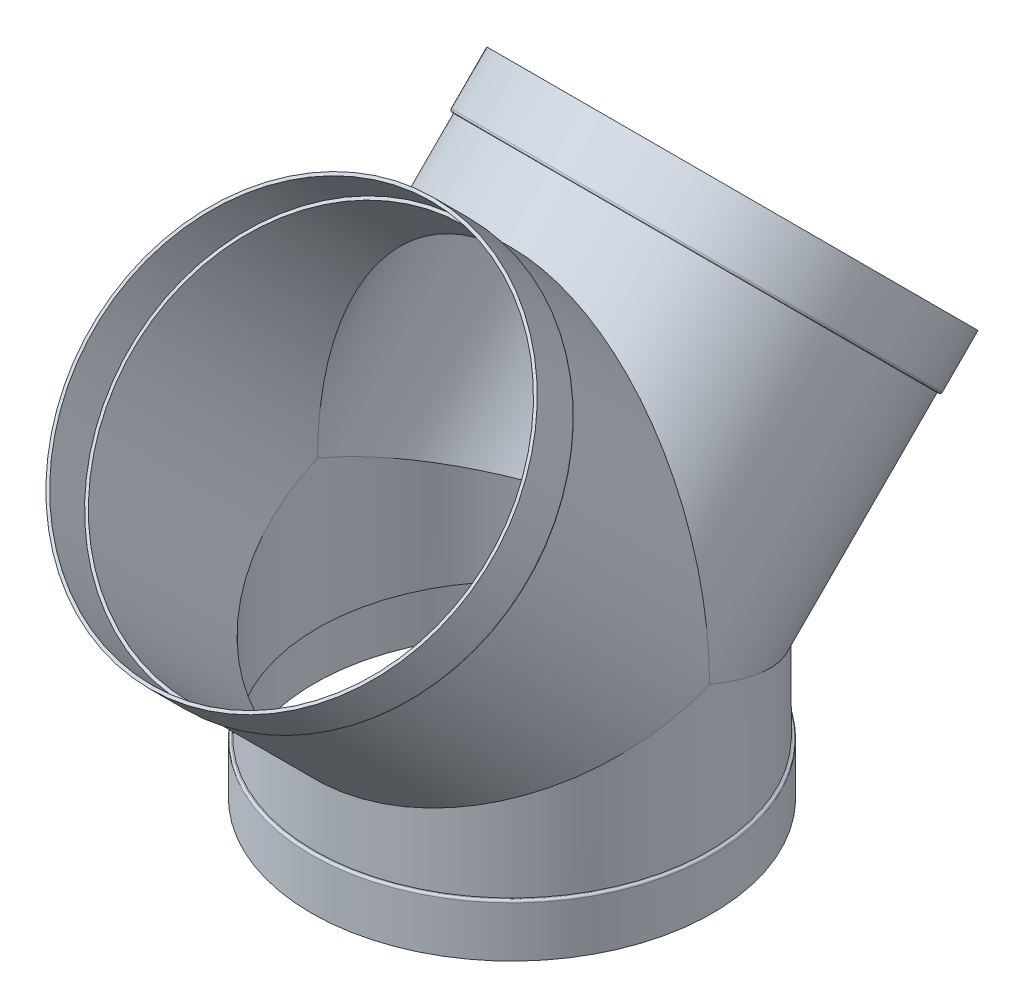
ISO-10303-21;
HEADER;
FILE_DESCRIPTION(('STEP AP214'),'2;1');
FILE_NAME('part.step','',(''),(''),'','','');
FILE_SCHEMA(('AUTOMOTIVE_DESIGN { 1 0 10303 214 1 1 1 1 }'));
ENDSEC;
DATA;
#1=APPLICATION_CONTEXT('core data for automotive mechanical design processes');
#2=APPLICATION_PROTOCOL_DEFINITION('international standard','automotive_design',2000,#1);
#3=PRODUCT_CONTEXT('',#1,'mechanical');
#4=PRODUCT('Part','Part','',(#3));
#5=PRODUCT_RELATED_PRODUCT_CATEGORY('part','',(#4));
#6=PRODUCT_DEFINITION_FORMATION('','',#4);
#7=PRODUCT_DEFINITION_CONTEXT('part definition',#1,'design');
#8=PRODUCT_DEFINITION('design','',#6,#7);
#9=PRODUCT_DEFINITION_SHAPE('','',#8);
#10=(LENGTH_UNIT() NAMED_UNIT(*) SI_UNIT(.MILLI.,.METRE.));
#11=(NAMED_UNIT(*) PLANE_ANGLE_UNIT() SI_UNIT($,.RADIAN.));
#12=(NAMED_UNIT(*) SI_UNIT($,.STERADIAN.) SOLID_ANGLE_UNIT());
#13=UNCERTAINTY_MEASURE_WITH_UNIT(LENGTH_MEASURE(1.E-05),#10,'distance_accuracy_value','');
#14=(GEOMETRIC_REPRESENTATION_CONTEXT(3) GLOBAL_UNCERTAINTY_ASSIGNED_CONTEXT((#13)) GLOBAL_UNIT_ASSIGNED_CONTEXT((#10,
#11,#12)) REPRESENTATION_CONTEXT('',''));
#15=CARTESIAN_POINT('',(0.,0.,0.));
#16=DIRECTION('',(0.,0.,1.));
#17=DIRECTION('',(1.,0.,0.));
#18=AXIS2_PLACEMENT_3D('',#15,#16,#17);
#19=CARTESIAN_POINT('',(0.,643.339700585494,-340.127200585495));
#20=DIRECTION('',(0.,0.707106781186547,-0.707106781186548));
#21=DIRECTION('',(0.,0.707106781186548,0.707106781186547));
#22=AXIS2_PLACEMENT_3D('',#19,#20,#21);
#23=CYLINDRICAL_SURFACE('',#22,304.8);
#24=CARTESIAN_POINT('',(0.,586.090567813678,-282.878067813679));
#25=DIRECTION('',(0.,0.707106781186547,-0.707106781186548));
#26=DIRECTION('',(0.,0.707106781186548,0.707106781186547));
#27=AXIS2_PLACEMENT_3D('',#24,#25,#26);
#28=CIRCLE('',#27,304.8);
#29=CARTESIAN_POINT('',(0.,801.616714719338,-67.351920908019));
#30=VERTEX_POINT('',#29);
#31=EDGE_CURVE('E133',#30,#30,#28,.T.);
#32=ORIENTED_EDGE('',*,*,#31,.F.);
#33=EDGE_LOOP('',(#32));
#34=FACE_BOUND('',#33,.T.);
#35=CARTESIAN_POINT('',(0.,303.2125,0.));
#36=DIRECTION('',(0.,0.,-1.));
#37=DIRECTION('',(0.,1.,0.));
#38=AXIS2_PLACEMENT_3D('',#35,#36,#37);
#39=ELLIPSE('',#38,431.052293811319,304.8);
#40=CARTESIAN_POINT('',(304.8,303.2125,0.));
#41=VERTEX_POINT('',#40);
#42=CARTESIAN_POINT('',(-304.8,303.2125,0.));
#43=VERTEX_POINT('',#42);
#44=EDGE_CURVE('E58',#41,#43,#39,.F.);
#45=ORIENTED_EDGE('',*,*,#44,.F.);
#46=CARTESIAN_POINT('',(0.,303.2125,0.));
#47=DIRECTION('',(0.,0.923879532511287,-0.38268343236509));
#48=DIRECTION('',(0.,-0.38268343236509,-0.923879532511287));
#49=AXIS2_PLACEMENT_3D('',#46,#47,#48);
#50=ELLIPSE('',#49,329.913142649122,304.8);
#51=EDGE_CURVE('E61',#41,#43,#50,.T.);
#52=ORIENTED_EDGE('',*,*,#51,.T.);
#53=EDGE_LOOP('',(#45,#52));
#54=FACE_BOUND('',#53,.T.);
#55=ADVANCED_FACE('F43',(#34,#54),#23,.T.);
#56=CARTESIAN_POINT('',(0.,-52.1137931034483,0.));
#57=DIRECTION('',(0.,-1.,0.));
#58=DIRECTION('',(0.,0.,-1.));
#59=AXIS2_PLACEMENT_3D('',#56,#57,#58);
#60=CYLINDRICAL_SURFACE('',#59,304.8);
#61=CARTESIAN_POINT('',(0.,80.9625,0.));
#62=DIRECTION('',(0.,-1.,0.));
#63=DIRECTION('',(0.,0.,-1.));
#64=AXIS2_PLACEMENT_3D('',#61,#62,#63);
#65=CIRCLE('',#64,304.8);
#66=CARTESIAN_POINT('',(0.,80.9625,-304.8));
#67=VERTEX_POINT('',#66);
#68=EDGE_CURVE('E145',#67,#67,#65,.T.);
#69=ORIENTED_EDGE('',*,*,#68,.F.);
#70=EDGE_LOOP('',(#69));
#71=FACE_BOUND('',#70,.T.);
#72=ORIENTED_EDGE('',*,*,#51,.F.);
#73=CARTESIAN_POINT('',(0.,303.2125,0.));
#74=DIRECTION('',(0.,0.923879532511287,0.38268343236509));
#75=DIRECTION('',(0.,-0.38268343236509,0.923879532511287));
#76=AXIS2_PLACEMENT_3D('',#73,#74,#75);
#77=ELLIPSE('',#76,329.913142649122,304.8);
#78=EDGE_CURVE('E151',#43,#41,#77,.T.);
#79=ORIENTED_EDGE('',*,*,#78,.F.);
#80=EDGE_LOOP('',(#72,#79));
#81=FACE_BOUND('',#80,.T.);
#82=ADVANCED_FACE('F191',(#71,#81),#60,.T.);
#83=CARTESIAN_POINT('',(0.,80.9625,309.5625));
#84=DIRECTION('',(0.,-1.,0.));
#85=DIRECTION('',(0.,0.,-1.));
#86=AXIS2_PLACEMENT_3D('',#83,#84,#85);
#87=PLANE('',#86);
#88=CARTESIAN_POINT('',(0.,80.9625,0.));
#89=DIRECTION('',(0.,-1.,0.));
#90=DIRECTION('',(0.,0.,-1.));
#91=AXIS2_PLACEMENT_3D('',#88,#89,#90);
#92=CIRCLE('',#91,306.3875);
#93=CARTESIAN_POINT('',(0.,80.9625,-306.3875));
#94=VERTEX_POINT('',#93);
#95=EDGE_CURVE('E161',#94,#94,#92,.F.);
#96=ORIENTED_EDGE('',*,*,#95,.T.);
#97=EDGE_LOOP('',(#96));
#98=FACE_BOUND('',#97,.T.);
#99=ORIENTED_EDGE('',*,*,#68,.T.);
#100=EDGE_LOOP('',(#99));
#101=FACE_BOUND('',#100,.T.);
#102=ADVANCED_FACE('F197',(#98,#101),#87,.F.);
#103=CARTESIAN_POINT('',(0.,-52.1137931034483,0.));
#104=DIRECTION('',(0.,-1.,0.));
#105=DIRECTION('',(0.,0.,-1.));
#106=AXIS2_PLACEMENT_3D('',#103,#104,#105);
#107=CYLINDRICAL_SURFACE('',#106,309.5625);
#108=CARTESIAN_POINT('',(0.,77.7875,0.));
#109=DIRECTION('',(0.,-1.,0.));
#110=DIRECTION('',(0.,0.,-1.));
#111=AXIS2_PLACEMENT_3D('',#108,#109,#110);
#112=CIRCLE('',#111,309.5625);
#113=CARTESIAN_POINT('',(0.,77.7875,-309.5625));
#114=VERTEX_POINT('',#113);
#115=EDGE_CURVE('E157',#114,#114,#112,.T.);
#116=ORIENTED_EDGE('',*,*,#115,.T.);
#117=EDGE_LOOP('',(#116));
#118=FACE_BOUND('',#117,.T.);
#119=CARTESIAN_POINT('',(0.,0.,0.));
#120=DIRECTION('',(0.,-1.,0.));
#121=DIRECTION('',(0.,0.,-1.));
#122=AXIS2_PLACEMENT_3D('',#119,#120,#121);
#123=CIRCLE('',#122,309.5625);
#124=CARTESIAN_POINT('',(0.,0.,-309.5625));
#125=VERTEX_POINT('',#124);
#126=EDGE_CURVE('E141',#125,#125,#123,.T.);
#127=ORIENTED_EDGE('',*,*,#126,.F.);
#128=EDGE_LOOP('',(#127));
#129=FACE_BOUND('',#128,.T.);
#130=ADVANCED_FACE('F221',(#118,#129),#107,.T.);
#131=CARTESIAN_POINT('',(0.,0.,309.5625));
#132=DIRECTION('',(0.,1.,0.));
#133=DIRECTION('',(0.,0.,1.));
#134=AXIS2_PLACEMENT_3D('',#131,#132,#133);
#135=PLANE('',#134);
#136=CARTESIAN_POINT('',(0.,0.,0.));
#137=DIRECTION('',(0.,1.,0.));
#138=DIRECTION('',(0.,0.,1.));
#139=AXIS2_PLACEMENT_3D('',#136,#137,#138);
#140=CIRCLE('',#139,304.8);
#141=CARTESIAN_POINT('',(0.,0.,304.8));
#142=VERTEX_POINT('',#141);
#143=EDGE_CURVE('E106',#142,#142,#140,.F.);
#144=ORIENTED_EDGE('',*,*,#143,.F.);
#145=EDGE_LOOP('',(#144));
#146=FACE_BOUND('',#145,.T.);
#147=ORIENTED_EDGE('',*,*,#126,.T.);
#148=EDGE_LOOP('',(#147));
#149=FACE_BOUND('',#148,.T.);
#150=ADVANCED_FACE('F217',(#146,#149),#135,.F.);
#151=CARTESIAN_POINT('',(0.,424.445957634433,-559.020943536555));
#152=DIRECTION('',(0.,-0.707106781186547,0.707106781186548));
#153=DIRECTION('',(0.,-0.707106781186548,-0.707106781186547));
#154=AXIS2_PLACEMENT_3D('',#151,#152,#153);
#155=PLANE('',#154);
#156=CARTESIAN_POINT('',(0.,643.339700585494,-340.127200585495));
#157=DIRECTION('',(0.,-0.707106781186547,0.707106781186548));
#158=DIRECTION('',(0.,-0.707106781186548,-0.707106781186547));
#159=AXIS2_PLACEMENT_3D('',#156,#157,#158);
#160=CIRCLE('',#159,304.8);
#161=CARTESIAN_POINT('',(0.,427.813553679834,-555.653347491154));
#162=VERTEX_POINT('',#161);
#163=EDGE_CURVE('E120',#162,#162,#160,.F.);
#164=ORIENTED_EDGE('',*,*,#163,.F.);
#165=EDGE_LOOP('',(#164));
#166=FACE_BOUND('',#165,.T.);
#167=CARTESIAN_POINT('',(0.,643.339700585494,-340.127200585494));
#168=DIRECTION('',(0.,0.707106781186547,-0.707106781186548));
#169=DIRECTION('',(0.,0.707106781186548,0.707106781186547));
#170=AXIS2_PLACEMENT_3D('',#167,#168,#169);
#171=CIRCLE('',#170,309.5625);
#172=CARTESIAN_POINT('',(0.,862.233443536555,-121.233457634434));
#173=VERTEX_POINT('',#172);
#174=EDGE_CURVE('E137',#173,#173,#171,.T.);
#175=ORIENTED_EDGE('',*,*,#174,.T.);
#176=EDGE_LOOP('',(#175));
#177=FACE_BOUND('',#176,.T.);
#178=ADVANCED_FACE('F213',(#166,#177),#155,.F.);
#179=CARTESIAN_POINT('',(0.,643.339700585494,-340.127200585495));
#180=DIRECTION('',(0.,0.707106781186547,-0.707106781186548));
#181=DIRECTION('',(0.,0.707106781186548,0.707106781186547));
#182=AXIS2_PLACEMENT_3D('',#179,#180,#181);
#183=CYLINDRICAL_SURFACE('',#182,309.5625);
#184=CARTESIAN_POINT('',(0.,588.335631843945,-285.123131843946));
#185=DIRECTION('',(0.,0.707106781186547,-0.707106781186548));
#186=DIRECTION('',(0.,0.707106781186548,0.707106781186547));
#187=AXIS2_PLACEMENT_3D('',#184,#185,#186);
#188=CIRCLE('',#187,309.5625);
#189=CARTESIAN_POINT('',(0.,807.229374795006,-66.2293888928853));
#190=VERTEX_POINT('',#189);
#191=EDGE_CURVE('E165',#190,#190,#188,.T.);
#192=ORIENTED_EDGE('',*,*,#191,.T.);
#193=EDGE_LOOP('',(#192));
#194=FACE_BOUND('',#193,.T.);
#195=ORIENTED_EDGE('',*,*,#174,.F.);
#196=EDGE_LOOP('',(#195));
#197=FACE_BOUND('',#196,.T.);
#198=ADVANCED_FACE('F209',(#194,#197),#183,.T.);
#199=CARTESIAN_POINT('',(0.,370.564420908018,-498.404214719338));
#200=DIRECTION('',(0.,0.707106781186547,-0.707106781186548));
#201=DIRECTION('',(0.,0.707106781186548,0.707106781186547));
#202=AXIS2_PLACEMENT_3D('',#199,#200,#201);
#203=PLANE('',#202);
#204=CARTESIAN_POINT('',(0.,586.090567813678,-282.878067813679));
#205=DIRECTION('',(0.,0.707106781186547,-0.707106781186548));
#206=DIRECTION('',(0.,0.707106781186548,0.707106781186547));
#207=AXIS2_PLACEMENT_3D('',#204,#205,#206);
#208=CIRCLE('',#207,306.3875);
#209=CARTESIAN_POINT('',(0.,802.739246734472,-66.2293888928854));
#210=VERTEX_POINT('',#209);
#211=EDGE_CURVE('E169',#210,#210,#208,.F.);
#212=ORIENTED_EDGE('',*,*,#211,.T.);
#213=EDGE_LOOP('',(#212));
#214=FACE_BOUND('',#213,.T.);
#215=ORIENTED_EDGE('',*,*,#31,.T.);
#216=EDGE_LOOP('',(#215));
#217=FACE_BOUND('',#216,.T.);
#218=ADVANCED_FACE('F205',(#214,#217),#203,.F.);
#219=CARTESIAN_POINT('',(0.,643.339700585494,340.127200585495));
#220=DIRECTION('',(0.,0.707106781186547,0.707106781186548));
#221=DIRECTION('',(0.,0.707106781186548,-0.707106781186547));
#222=AXIS2_PLACEMENT_3D('',#219,#220,#221);
#223=CYLINDRICAL_SURFACE('',#222,304.8);
#224=ORIENTED_EDGE('',*,*,#78,.T.);
#225=ORIENTED_EDGE('',*,*,#44,.T.);
#226=EDGE_LOOP('',(#224,#225));
#227=FACE_BOUND('',#226,.T.);
#228=CARTESIAN_POINT('',(0.,586.090567813678,282.878067813679));
#229=DIRECTION('',(0.,-0.707106781186547,-0.707106781186548));
#230=DIRECTION('',(0.,0.707106781186548,-0.707106781186547));
#231=AXIS2_PLACEMENT_3D('',#228,#229,#230);
#232=CIRCLE('',#231,304.8);
#233=CARTESIAN_POINT('',(0.,801.616714719338,67.351920908019));
#234=VERTEX_POINT('',#233);
#235=EDGE_CURVE('E88',#234,#234,#232,.T.);
#236=ORIENTED_EDGE('',*,*,#235,.T.);
#237=EDGE_LOOP('',(#236));
#238=FACE_BOUND('',#237,.T.);
#239=ADVANCED_FACE('F208',(#227,#238),#223,.T.);
#240=CARTESIAN_POINT('',(0.,424.445957634433,559.020943536555));
#241=DIRECTION('',(0.,-0.707106781186547,-0.707106781186548));
#242=DIRECTION('',(0.,-0.707106781186548,0.707106781186547));
#243=AXIS2_PLACEMENT_3D('',#240,#241,#242);
#244=PLANE('',#243);
#245=CARTESIAN_POINT('',(0.,643.339700585494,340.127200585495));
#246=DIRECTION('',(0.,-0.707106781186547,-0.707106781186548));
#247=DIRECTION('',(0.,0.707106781186548,-0.707106781186547));
#248=AXIS2_PLACEMENT_3D('',#245,#246,#247);
#249=CIRCLE('',#248,304.8);
#250=CARTESIAN_POINT('',(0.,858.865847491154,124.601053679835));
#251=VERTEX_POINT('',#250);
#252=EDGE_CURVE('E115',#251,#251,#249,.T.);
#253=ORIENTED_EDGE('',*,*,#252,.T.);
#254=EDGE_LOOP('',(#253));
#255=FACE_BOUND('',#254,.T.);
#256=CARTESIAN_POINT('',(0.,643.339700585494,340.127200585494));
#257=DIRECTION('',(0.,-0.707106781186547,-0.707106781186548));
#258=DIRECTION('',(0.,0.707106781186548,-0.707106781186547));
#259=AXIS2_PLACEMENT_3D('',#256,#257,#258);
#260=CIRCLE('',#259,309.5625);
#261=CARTESIAN_POINT('',(0.,862.233443536555,121.233457634434));
#262=VERTEX_POINT('',#261);
#263=EDGE_CURVE('E94',#262,#262,#260,.T.);
#264=ORIENTED_EDGE('',*,*,#263,.F.);
#265=EDGE_LOOP('',(#264));
#266=FACE_BOUND('',#265,.T.);
#267=ADVANCED_FACE('F203',(#255,#266),#244,.F.);
#268=CARTESIAN_POINT('',(0.,643.339700585494,340.127200585495));
#269=DIRECTION('',(0.,0.707106781186547,0.707106781186548));
#270=DIRECTION('',(0.,0.707106781186548,-0.707106781186547));
#271=AXIS2_PLACEMENT_3D('',#268,#269,#270);
#272=CYLINDRICAL_SURFACE('',#271,309.5625);
#273=CARTESIAN_POINT('',(0.,588.335631843945,285.123131843946));
#274=DIRECTION('',(0.,0.707106781186547,0.707106781186548));
#275=DIRECTION('',(0.,-0.707106781186548,0.707106781186547));
#276=AXIS2_PLACEMENT_3D('',#273,#274,#275);
#277=CIRCLE('',#276,309.5625);
#278=CARTESIAN_POINT('',(0.,369.441888892884,504.016874795006));
#279=VERTEX_POINT('',#278);
#280=EDGE_CURVE('E11',#279,#279,#277,.T.);
#281=ORIENTED_EDGE('',*,*,#280,.T.);
#282=EDGE_LOOP('',(#281));
#283=FACE_BOUND('',#282,.T.);
#284=ORIENTED_EDGE('',*,*,#263,.T.);
#285=EDGE_LOOP('',(#284));
#286=FACE_BOUND('',#285,.T.);
#287=ADVANCED_FACE('F253',(#283,#286),#272,.T.);
#288=CARTESIAN_POINT('',(0.,370.564420908018,498.404214719338));
#289=DIRECTION('',(0.,0.707106781186547,0.707106781186548));
#290=DIRECTION('',(0.,0.707106781186548,-0.707106781186547));
#291=AXIS2_PLACEMENT_3D('',#288,#289,#290);
#292=PLANE('',#291);
#293=CARTESIAN_POINT('',(0.,586.090567813678,282.878067813679));
#294=DIRECTION('',(0.,0.707106781186547,0.707106781186548));
#295=DIRECTION('',(0.,-0.707106781186548,0.707106781186547));
#296=AXIS2_PLACEMENT_3D('',#293,#294,#295);
#297=CIRCLE('',#296,306.3875);
#298=CARTESIAN_POINT('',(0.,369.441888892884,499.526746734472));
#299=VERTEX_POINT('',#298);
#300=EDGE_CURVE('E52',#299,#299,#297,.F.);
#301=ORIENTED_EDGE('',*,*,#300,.T.);
#302=EDGE_LOOP('',(#301));
#303=FACE_BOUND('',#302,.T.);
#304=ORIENTED_EDGE('',*,*,#235,.F.);
#305=EDGE_LOOP('',(#304));
#306=FACE_BOUND('',#305,.T.);
#307=ADVANCED_FACE('F178',(#303,#306),#292,.F.);
#308=CARTESIAN_POINT('',(0.,643.339700585494,-340.127200585495));
#309=DIRECTION('',(0.,0.707106781186547,-0.707106781186548));
#310=DIRECTION('',(0.,0.707106781186548,0.707106781186547));
#311=AXIS2_PLACEMENT_3D('',#308,#309,#310);
#312=CYLINDRICAL_SURFACE('',#311,300.0375);
#313=CARTESIAN_POINT('',(0.,589.458163859079,-286.245663859079));
#314=DIRECTION('',(0.,0.707106781186547,-0.707106781186548));
#315=DIRECTION('',(0.,0.707106781186548,0.707106781186547));
#316=AXIS2_PLACEMENT_3D('',#313,#314,#315);
#317=CIRCLE('',#316,300.0375);
#318=CARTESIAN_POINT('',(0.,801.616714719338,-74.0871129988209));
#319=VERTEX_POINT('',#318);
#320=EDGE_CURVE('E97',#319,#319,#317,.T.);
#321=ORIENTED_EDGE('',*,*,#320,.T.);
#322=EDGE_LOOP('',(#321));
#323=FACE_BOUND('',#322,.T.);
#324=CARTESIAN_POINT('',(0.,303.2125,0.));
#325=DIRECTION('',(0.,0.,-1.));
#326=DIRECTION('',(0.,1.,0.));
#327=AXIS2_PLACEMENT_3D('',#324,#325,#326);
#328=ELLIPSE('',#327,424.317101720517,300.0375);
#329=CARTESIAN_POINT('',(300.0375,303.2125,0.));
#330=VERTEX_POINT('',#329);
#331=CARTESIAN_POINT('',(-300.0375,303.2125,0.));
#332=VERTEX_POINT('',#331);
#333=EDGE_CURVE('E83',#330,#332,#328,.F.);
#334=ORIENTED_EDGE('',*,*,#333,.T.);
#335=CARTESIAN_POINT('',(0.,303.2125,0.));
#336=DIRECTION('',(0.,-0.923879532511287,0.38268343236509));
#337=DIRECTION('',(0.,-0.38268343236509,-0.923879532511287));
#338=AXIS2_PLACEMENT_3D('',#335,#336,#337);
#339=ELLIPSE('',#338,324.758249795229,300.0375);
#340=EDGE_CURVE('E71',#330,#332,#339,.F.);
#341=ORIENTED_EDGE('',*,*,#340,.F.);
#342=EDGE_LOOP('',(#334,#341));
#343=FACE_BOUND('',#342,.T.);
#344=ADVANCED_FACE('F86',(#323,#343),#312,.F.);
#345=CARTESIAN_POINT('',(0.,-52.1137931034483,0.));
#346=DIRECTION('',(0.,-1.,0.));
#347=DIRECTION('',(0.,0.,-1.));
#348=AXIS2_PLACEMENT_3D('',#345,#346,#347);
#349=CYLINDRICAL_SURFACE('',#348,300.0375);
#350=CARTESIAN_POINT('',(0.,76.2,0.));
#351=DIRECTION('',(0.,-1.,0.));
#352=DIRECTION('',(0.,0.,-1.));
#353=AXIS2_PLACEMENT_3D('',#350,#351,#352);
#354=CIRCLE('',#353,300.0375);
#355=CARTESIAN_POINT('',(0.,76.2,-300.0375));
#356=VERTEX_POINT('',#355);
#357=EDGE_CURVE('E78',#356,#356,#354,.T.);
#358=ORIENTED_EDGE('',*,*,#357,.T.);
#359=EDGE_LOOP('',(#358));
#360=FACE_BOUND('',#359,.T.);
#361=ORIENTED_EDGE('',*,*,#340,.T.);
#362=CARTESIAN_POINT('',(0.,303.2125,0.));
#363=DIRECTION('',(0.,-0.923879532511287,-0.38268343236509));
#364=DIRECTION('',(0.,-0.38268343236509,0.923879532511287));
#365=AXIS2_PLACEMENT_3D('',#362,#363,#364);
#366=ELLIPSE('',#365,324.758249795229,300.0375);
#367=EDGE_CURVE('E74',#332,#330,#366,.F.);
#368=ORIENTED_EDGE('',*,*,#367,.T.);
#369=EDGE_LOOP('',(#361,#368));
#370=FACE_BOUND('',#369,.T.);
#371=ADVANCED_FACE('F73',(#360,#370),#349,.F.);
#372=CARTESIAN_POINT('',(0.,76.2,309.5625));
#373=DIRECTION('',(0.,-1.,0.));
#374=DIRECTION('',(0.,0.,-1.));
#375=AXIS2_PLACEMENT_3D('',#372,#373,#374);
#376=PLANE('',#375);
#377=CARTESIAN_POINT('',(0.,76.2,0.));
#378=DIRECTION('',(0.,-1.,0.));
#379=DIRECTION('',(0.,0.,-1.));
#380=AXIS2_PLACEMENT_3D('',#377,#378,#379);
#381=CIRCLE('',#380,304.8);
#382=CARTESIAN_POINT('',(0.,76.2,-304.8));
#383=VERTEX_POINT('',#382);
#384=EDGE_CURVE('E101',#383,#383,#381,.T.);
#385=ORIENTED_EDGE('',*,*,#384,.T.);
#386=EDGE_LOOP('',(#385));
#387=FACE_BOUND('',#386,.T.);
#388=ORIENTED_EDGE('',*,*,#357,.F.);
#389=EDGE_LOOP('',(#388));
#390=FACE_BOUND('',#389,.T.);
#391=ADVANCED_FACE('F279',(#387,#390),#376,.T.);
#392=CARTESIAN_POINT('',(0.,-52.1137931034483,0.));
#393=DIRECTION('',(0.,-1.,0.));
#394=DIRECTION('',(0.,0.,-1.));
#395=AXIS2_PLACEMENT_3D('',#392,#393,#394);
#396=CYLINDRICAL_SURFACE('',#395,304.8);
#397=ORIENTED_EDGE('',*,*,#143,.T.);
#398=EDGE_LOOP('',(#397));
#399=FACE_BOUND('',#398,.T.);
#400=ORIENTED_EDGE('',*,*,#384,.F.);
#401=EDGE_LOOP('',(#400));
#402=FACE_BOUND('',#401,.T.);
#403=ADVANCED_FACE('F275',(#399,#402),#396,.F.);
#404=CARTESIAN_POINT('',(0.,643.339700585494,-340.127200585495));
#405=DIRECTION('',(0.,0.707106781186547,-0.707106781186548));
#406=DIRECTION('',(0.,0.707106781186548,0.707106781186547));
#407=AXIS2_PLACEMENT_3D('',#404,#405,#406);
#408=CYLINDRICAL_SURFACE('',#407,304.8);
#409=ORIENTED_EDGE('',*,*,#163,.T.);
#410=EDGE_LOOP('',(#409));
#411=FACE_BOUND('',#410,.T.);
#412=CARTESIAN_POINT('',(0.,589.458163859079,-286.245663859079));
#413=DIRECTION('',(0.,0.707106781186547,-0.707106781186548));
#414=DIRECTION('',(0.,0.707106781186548,0.707106781186547));
#415=AXIS2_PLACEMENT_3D('',#412,#413,#414);
#416=CIRCLE('',#415,304.8);
#417=CARTESIAN_POINT('',(0.,804.984310764739,-70.7195169534199));
#418=VERTEX_POINT('',#417);
#419=EDGE_CURVE('E116',#418,#418,#416,.T.);
#420=ORIENTED_EDGE('',*,*,#419,.F.);
#421=EDGE_LOOP('',(#420));
#422=FACE_BOUND('',#421,.T.);
#423=ADVANCED_FACE('F271',(#411,#422),#408,.F.);
#424=CARTESIAN_POINT('',(0.,373.932016953419,-501.771810764739));
#425=DIRECTION('',(0.,0.707106781186547,-0.707106781186548));
#426=DIRECTION('',(0.,0.707106781186548,0.707106781186547));
#427=AXIS2_PLACEMENT_3D('',#424,#425,#426);
#428=PLANE('',#427);
#429=ORIENTED_EDGE('',*,*,#419,.T.);
#430=EDGE_LOOP('',(#429));
#431=FACE_BOUND('',#430,.T.);
#432=ORIENTED_EDGE('',*,*,#320,.F.);
#433=EDGE_LOOP('',(#432));
#434=FACE_BOUND('',#433,.T.);
#435=ADVANCED_FACE('F268',(#431,#434),#428,.T.);
#436=CARTESIAN_POINT('',(0.,643.339700585494,340.127200585495));
#437=DIRECTION('',(0.,0.707106781186547,0.707106781186548));
#438=DIRECTION('',(0.,0.707106781186548,-0.707106781186547));
#439=AXIS2_PLACEMENT_3D('',#436,#437,#438);
#440=CYLINDRICAL_SURFACE('',#439,300.0375);
#441=ORIENTED_EDGE('',*,*,#367,.F.);
#442=ORIENTED_EDGE('',*,*,#333,.F.);
#443=EDGE_LOOP('',(#441,#442));
#444=FACE_BOUND('',#443,.T.);
#445=CARTESIAN_POINT('',(0.,589.458163859079,286.245663859079));
#446=DIRECTION('',(0.,0.707106781186547,0.707106781186548));
#447=DIRECTION('',(0.,-0.707106781186548,0.707106781186547));
#448=AXIS2_PLACEMENT_3D('',#445,#446,#447);
#449=CIRCLE('',#448,300.0375);
#450=CARTESIAN_POINT('',(0.,377.29961299882,498.404214719338));
#451=VERTEX_POINT('',#450);
#452=EDGE_CURVE('E107',#451,#451,#449,.F.);
#453=ORIENTED_EDGE('',*,*,#452,.F.);
#454=EDGE_LOOP('',(#453));
#455=FACE_BOUND('',#454,.T.);
#456=ADVANCED_FACE('F81',(#444,#455),#440,.F.);
#457=CARTESIAN_POINT('',(0.,643.339700585494,340.127200585495));
#458=DIRECTION('',(0.,0.707106781186547,0.707106781186548));
#459=DIRECTION('',(0.,0.707106781186548,-0.707106781186547));
#460=AXIS2_PLACEMENT_3D('',#457,#458,#459);
#461=CYLINDRICAL_SURFACE('',#460,304.8);
#462=ORIENTED_EDGE('',*,*,#252,.F.);
#463=EDGE_LOOP('',(#462));
#464=FACE_BOUND('',#463,.T.);
#465=CARTESIAN_POINT('',(0.,589.458163859079,286.245663859079));
#466=DIRECTION('',(0.,0.707106781186547,0.707106781186548));
#467=DIRECTION('',(0.,-0.707106781186548,0.707106781186547));
#468=AXIS2_PLACEMENT_3D('',#465,#466,#467);
#469=CIRCLE('',#468,304.8);
#470=CARTESIAN_POINT('',(0.,373.932016953419,501.771810764739));
#471=VERTEX_POINT('',#470);
#472=EDGE_CURVE('E111',#471,#471,#469,.F.);
#473=ORIENTED_EDGE('',*,*,#472,.T.);
#474=EDGE_LOOP('',(#473));
#475=FACE_BOUND('',#474,.T.);
#476=ADVANCED_FACE('F235',(#464,#475),#461,.F.);
#477=CARTESIAN_POINT('',(0.,373.932016953419,501.771810764739));
#478=DIRECTION('',(0.,0.707106781186547,0.707106781186548));
#479=DIRECTION('',(0.,0.707106781186548,-0.707106781186547));
#480=AXIS2_PLACEMENT_3D('',#477,#478,#479);
#481=PLANE('',#480);
#482=ORIENTED_EDGE('',*,*,#472,.F.);
#483=EDGE_LOOP('',(#482));
#484=FACE_BOUND('',#483,.T.);
#485=ORIENTED_EDGE('',*,*,#452,.T.);
#486=EDGE_LOOP('',(#485));
#487=FACE_BOUND('',#486,.T.);
#488=ADVANCED_FACE('F230',(#484,#487),#481,.T.);
#489=CARTESIAN_POINT('',(0.,77.7875,0.));
#490=DIRECTION('',(0.,-1.,0.));
#491=DIRECTION('',(0.,0.,-1.));
#492=AXIS2_PLACEMENT_3D('',#489,#490,#491);
#493=TOROIDAL_SURFACE('',#492,306.3875,3.175);
#494=ORIENTED_EDGE('',*,*,#95,.F.);
#495=EDGE_LOOP('',(#494));
#496=FACE_BOUND('',#495,.T.);
#497=ORIENTED_EDGE('',*,*,#115,.F.);
#498=EDGE_LOOP('',(#497));
#499=FACE_BOUND('',#498,.T.);
#500=ADVANCED_FACE('F187',(#496,#499),#493,.T.);
#501=CARTESIAN_POINT('',(0.,588.335631843945,-285.123131843946));
#502=DIRECTION('',(0.,0.707106781186547,-0.707106781186548));
#503=DIRECTION('',(0.,0.707106781186548,0.707106781186547));
#504=AXIS2_PLACEMENT_3D('',#501,#502,#503);
#505=TOROIDAL_SURFACE('',#504,306.3875,3.175);
#506=ORIENTED_EDGE('',*,*,#211,.F.);
#507=EDGE_LOOP('',(#506));
#508=FACE_BOUND('',#507,.T.);
#509=ORIENTED_EDGE('',*,*,#191,.F.);
#510=EDGE_LOOP('',(#509));
#511=FACE_BOUND('',#510,.T.);
#512=ADVANCED_FACE('F182',(#508,#511),#505,.T.);
#513=CARTESIAN_POINT('',(0.,588.335631843945,285.123131843946));
#514=DIRECTION('',(0.,0.707106781186547,0.707106781186548));
#515=DIRECTION('',(0.,-0.707106781186548,0.707106781186547));
#516=AXIS2_PLACEMENT_3D('',#513,#514,#515);
#517=TOROIDAL_SURFACE('',#516,306.3875,3.175);
#518=ORIENTED_EDGE('',*,*,#280,.F.);
#519=EDGE_LOOP('',(#518));
#520=FACE_BOUND('',#519,.T.);
#521=ORIENTED_EDGE('',*,*,#300,.F.);
#522=EDGE_LOOP('',(#521));
#523=FACE_BOUND('',#522,.T.);
#524=ADVANCED_FACE('F45',(#520,#523),#517,.T.);
#525=CLOSED_SHELL('',(#55,#82,#102,#130,#150,#178,#198,#218,#239,#267,#287,#307,#344,#371,#391,
#403,#423,#435,#456,#476,#488,#500,#512,#524));
#526=MANIFOLD_SOLID_BREP('B2',#525);
#527=ADVANCED_BREP_SHAPE_REPRESENTATION('',(#18,#526),#14);
#528=SHAPE_DEFINITION_REPRESENTATION(#9,#527);
ENDSEC;
END-ISO-10303-21;
